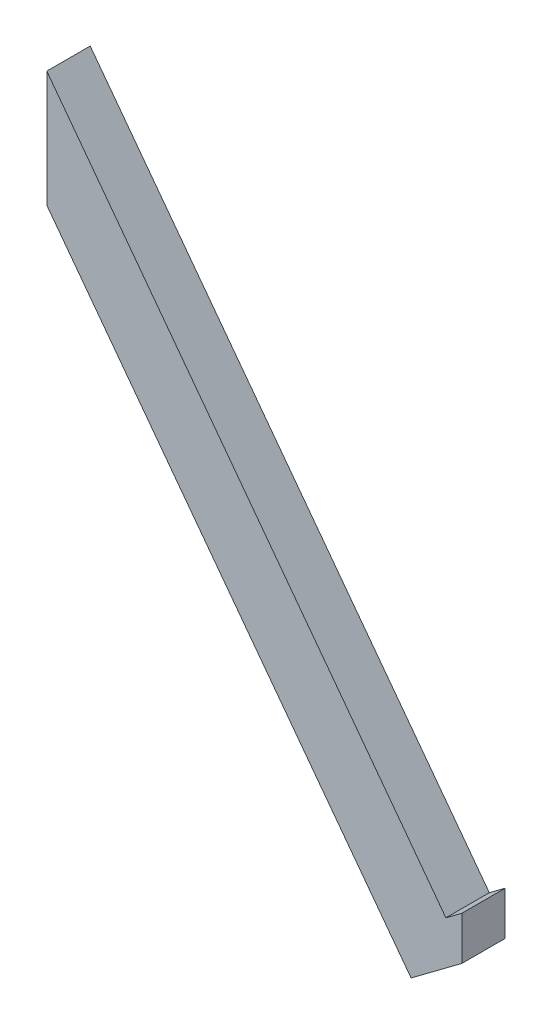
ISO-10303-21;
HEADER;
FILE_DESCRIPTION(('STEP AP214'),'2;1');
FILE_NAME('part.step','',(''),(''),'','','');
FILE_SCHEMA(('AUTOMOTIVE_DESIGN { 1 0 10303 214 1 1 1 1 }'));
ENDSEC;
DATA;
#1=APPLICATION_CONTEXT('core data for automotive mechanical design processes');
#2=APPLICATION_PROTOCOL_DEFINITION('international standard','automotive_design',2000,#1);
#3=PRODUCT_CONTEXT('',#1,'mechanical');
#4=PRODUCT('Part','Part','',(#3));
#5=PRODUCT_RELATED_PRODUCT_CATEGORY('part','',(#4));
#6=PRODUCT_DEFINITION_FORMATION('','',#4);
#7=PRODUCT_DEFINITION_CONTEXT('part definition',#1,'design');
#8=PRODUCT_DEFINITION('design','',#6,#7);
#9=PRODUCT_DEFINITION_SHAPE('','',#8);
#10=(LENGTH_UNIT() NAMED_UNIT(*) SI_UNIT(.MILLI.,.METRE.));
#11=(NAMED_UNIT(*) PLANE_ANGLE_UNIT() SI_UNIT($,.RADIAN.));
#12=(NAMED_UNIT(*) SI_UNIT($,.STERADIAN.) SOLID_ANGLE_UNIT());
#13=UNCERTAINTY_MEASURE_WITH_UNIT(LENGTH_MEASURE(1.E-05),#10,'distance_accuracy_value','');
#14=(GEOMETRIC_REPRESENTATION_CONTEXT(3) GLOBAL_UNCERTAINTY_ASSIGNED_CONTEXT((#13)) GLOBAL_UNIT_ASSIGNED_CONTEXT((#10,
#11,#12)) REPRESENTATION_CONTEXT('',''));
#15=CARTESIAN_POINT('',(0.,0.,0.));
#16=DIRECTION('',(0.,0.,1.));
#17=DIRECTION('',(1.,0.,0.));
#18=AXIS2_PLACEMENT_3D('',#15,#16,#17);
#19=CARTESIAN_POINT('',(-48.4510576676489,25.0386405763315,5.));
#20=DIRECTION('',(1.,0.,0.));
#21=DIRECTION('',(0.,0.,-1.));
#22=AXIS2_PLACEMENT_3D('',#19,#20,#21);
#23=PLANE('',#22);
#24=DIRECTION('',(0.,-1.,0.));
#25=VECTOR('',#24,1.);
#26=CARTESIAN_POINT('',(-48.4510576676489,25.0386405763315,0.));
#27=LINE('',#26,#25);
#28=CARTESIAN_POINT('',(-48.4510576676489,38.3967930670941,0.));
#29=VERTEX_POINT('',#28);
#30=CARTESIAN_POINT('',(-48.4510576676489,25.0386405763315,0.));
#31=VERTEX_POINT('',#30);
#32=EDGE_CURVE('E117',#29,#31,#27,.T.);
#33=ORIENTED_EDGE('',*,*,#32,.T.);
#34=DIRECTION('',(0.,0.,-1.));
#35=VECTOR('',#34,1.);
#36=CARTESIAN_POINT('',(-48.4510576676489,25.0386405763315,5.));
#37=LINE('',#36,#35);
#38=CARTESIAN_POINT('',(-48.4510576676489,25.0386405763315,5.));
#39=VERTEX_POINT('',#38);
#40=EDGE_CURVE('E11',#39,#31,#37,.T.);
#41=ORIENTED_EDGE('',*,*,#40,.F.);
#42=DIRECTION('',(0.,-1.,0.));
#43=VECTOR('',#42,1.);
#44=CARTESIAN_POINT('',(-48.4510576676489,25.0386405763315,5.));
#45=LINE('',#44,#43);
#46=CARTESIAN_POINT('',(-48.4510576676489,38.3967930670941,5.));
#47=VERTEX_POINT('',#46);
#48=EDGE_CURVE('E127',#47,#39,#45,.T.);
#49=ORIENTED_EDGE('',*,*,#48,.F.);
#50=DIRECTION('',(0.,0.,-1.));
#51=VECTOR('',#50,1.);
#52=CARTESIAN_POINT('',(-48.4510576676489,38.3967930670941,5.));
#53=LINE('',#52,#51);
#54=EDGE_CURVE('E113',#47,#29,#53,.T.);
#55=ORIENTED_EDGE('',*,*,#54,.T.);
#56=EDGE_LOOP('',(#33,#41,#49,#55));
#57=FACE_BOUND('',#56,.T.);
#58=ADVANCED_FACE('F33',(#57),#23,.F.);
#59=CARTESIAN_POINT('',(-6.52909275616516,-31.0198008750711,5.));
#60=DIRECTION('',(0.800834877877179,0.598885213021196,0.));
#61=DIRECTION('',(-0.598885213021196,0.80083487787718,0.));
#62=AXIS2_PLACEMENT_3D('',#59,#60,#61);
#63=PLANE('',#62);
#64=DIRECTION('',(0.598885213021196,-0.800834877877179,0.));
#65=VECTOR('',#64,1.);
#66=CARTESIAN_POINT('',(-6.52909275616516,-31.0198008750711,0.));
#67=LINE('',#66,#65);
#68=CARTESIAN_POINT('',(-6.52909275616516,-31.0198008750711,0.));
#69=VERTEX_POINT('',#68);
#70=EDGE_CURVE('E120',#31,#69,#67,.T.);
#71=ORIENTED_EDGE('',*,*,#70,.T.);
#72=DIRECTION('',(0.,0.,-1.));
#73=VECTOR('',#72,1.);
#74=CARTESIAN_POINT('',(-6.52909275616516,-31.0198008750711,5.));
#75=LINE('',#74,#73);
#76=CARTESIAN_POINT('',(-6.52909275616516,-31.0198008750711,5.));
#77=VERTEX_POINT('',#76);
#78=EDGE_CURVE('E41',#77,#69,#75,.T.);
#79=ORIENTED_EDGE('',*,*,#78,.F.);
#80=DIRECTION('',(0.598885213021196,-0.800834877877179,0.));
#81=VECTOR('',#80,1.);
#82=CARTESIAN_POINT('',(-6.52909275616516,-31.0198008750711,5.));
#83=LINE('',#82,#81);
#84=EDGE_CURVE('E86',#39,#77,#83,.T.);
#85=ORIENTED_EDGE('',*,*,#84,.F.);
#86=ORIENTED_EDGE('',*,*,#40,.T.);
#87=EDGE_LOOP('',(#71,#79,#85,#86));
#88=FACE_BOUND('',#87,.T.);
#89=ADVANCED_FACE('F151',(#88),#63,.F.);
#90=CARTESIAN_POINT('',(-0.693903445079616,-26.6560940859115,5.));
#91=DIRECTION('',(-0.598885213021196,0.80083487787718,0.));
#92=DIRECTION('',(-0.80083487787718,-0.598885213021196,0.));
#93=AXIS2_PLACEMENT_3D('',#90,#91,#92);
#94=PLANE('',#93);
#95=DIRECTION('',(0.80083487787718,0.598885213021196,0.));
#96=VECTOR('',#95,1.);
#97=CARTESIAN_POINT('',(-0.693903445079616,-26.6560940859115,0.));
#98=LINE('',#97,#96);
#99=CARTESIAN_POINT('',(-0.693903445079616,-26.6560940859115,0.));
#100=VERTEX_POINT('',#99);
#101=EDGE_CURVE('E122',#69,#100,#98,.T.);
#102=ORIENTED_EDGE('',*,*,#101,.T.);
#103=DIRECTION('',(0.,0.,-1.));
#104=VECTOR('',#103,1.);
#105=CARTESIAN_POINT('',(-0.693903445079616,-26.6560940859115,5.));
#106=LINE('',#105,#104);
#107=CARTESIAN_POINT('',(-0.693903445079616,-26.6560940859115,5.));
#108=VERTEX_POINT('',#107);
#109=EDGE_CURVE('E108',#108,#100,#106,.T.);
#110=ORIENTED_EDGE('',*,*,#109,.F.);
#111=DIRECTION('',(0.80083487787718,0.598885213021196,0.));
#112=VECTOR('',#111,1.);
#113=CARTESIAN_POINT('',(-0.693903445079616,-26.6560940859115,5.));
#114=LINE('',#113,#112);
#115=EDGE_CURVE('E99',#77,#108,#114,.T.);
#116=ORIENTED_EDGE('',*,*,#115,.F.);
#117=ORIENTED_EDGE('',*,*,#78,.T.);
#118=EDGE_LOOP('',(#102,#110,#116,#117));
#119=FACE_BOUND('',#118,.T.);
#120=ADVANCED_FACE('F133',(#119),#94,.F.);
#121=CARTESIAN_POINT('',(-0.693903445079618,-21.6496036691413,5.));
#122=DIRECTION('',(-1.,0.,0.));
#123=DIRECTION('',(0.,-1.,0.));
#124=AXIS2_PLACEMENT_3D('',#121,#122,#123);
#125=PLANE('',#124);
#126=DIRECTION('',(0.,1.,0.));
#127=VECTOR('',#126,1.);
#128=CARTESIAN_POINT('',(-0.693903445079618,-21.6496036691413,0.));
#129=LINE('',#128,#127);
#130=CARTESIAN_POINT('',(-0.693903445079618,-21.6496036691413,0.));
#131=VERTEX_POINT('',#130);
#132=EDGE_CURVE('E107',#100,#131,#129,.T.);
#133=ORIENTED_EDGE('',*,*,#132,.T.);
#134=DIRECTION('',(0.,0.,-1.));
#135=VECTOR('',#134,1.);
#136=CARTESIAN_POINT('',(-0.693903445079618,-21.6496036691413,5.));
#137=LINE('',#136,#135);
#138=CARTESIAN_POINT('',(-0.693903445079618,-21.6496036691413,5.));
#139=VERTEX_POINT('',#138);
#140=EDGE_CURVE('E104',#139,#131,#137,.T.);
#141=ORIENTED_EDGE('',*,*,#140,.F.);
#142=DIRECTION('',(0.,1.,0.));
#143=VECTOR('',#142,1.);
#144=CARTESIAN_POINT('',(-0.693903445079618,-21.6496036691413,5.));
#145=LINE('',#144,#143);
#146=EDGE_CURVE('E93',#108,#139,#145,.T.);
#147=ORIENTED_EDGE('',*,*,#146,.F.);
#148=ORIENTED_EDGE('',*,*,#109,.T.);
#149=EDGE_LOOP('',(#133,#141,#147,#148));
#150=FACE_BOUND('',#149,.T.);
#151=ADVANCED_FACE('F105',(#150),#125,.F.);
#152=CARTESIAN_POINT('',(-2.5235674221956,-23.0178741215933,5.));
#153=DIRECTION('',(0.598885213021197,-0.800834877877179,0.));
#154=DIRECTION('',(0.800834877877179,0.598885213021197,0.));
#155=AXIS2_PLACEMENT_3D('',#152,#153,#154);
#156=PLANE('',#155);
#157=DIRECTION('',(-0.800834877877179,-0.598885213021197,0.));
#158=VECTOR('',#157,1.);
#159=CARTESIAN_POINT('',(-2.5235674221956,-23.0178741215933,0.));
#160=LINE('',#159,#158);
#161=CARTESIAN_POINT('',(-2.5235674221956,-23.0178741215933,0.));
#162=VERTEX_POINT('',#161);
#163=EDGE_CURVE('E72',#131,#162,#160,.T.);
#164=ORIENTED_EDGE('',*,*,#163,.T.);
#165=DIRECTION('',(0.,0.,-1.));
#166=VECTOR('',#165,1.);
#167=CARTESIAN_POINT('',(-2.5235674221956,-23.0178741215933,5.));
#168=LINE('',#167,#166);
#169=CARTESIAN_POINT('',(-2.5235674221956,-23.0178741215933,5.));
#170=VERTEX_POINT('',#169);
#171=EDGE_CURVE('E109',#170,#162,#168,.T.);
#172=ORIENTED_EDGE('',*,*,#171,.F.);
#173=DIRECTION('',(-0.800834877877179,-0.598885213021197,0.));
#174=VECTOR('',#173,1.);
#175=CARTESIAN_POINT('',(-2.5235674221956,-23.0178741215933,5.));
#176=LINE('',#175,#174);
#177=EDGE_CURVE('E97',#139,#170,#176,.T.);
#178=ORIENTED_EDGE('',*,*,#177,.F.);
#179=ORIENTED_EDGE('',*,*,#140,.T.);
#180=EDGE_LOOP('',(#164,#172,#178,#179));
#181=FACE_BOUND('',#180,.T.);
#182=ADVANCED_FACE('F111',(#181),#156,.F.);
#183=CARTESIAN_POINT('',(-48.4510576676489,38.3967930670941,5.));
#184=DIRECTION('',(-0.800834877877179,-0.598885213021196,0.));
#185=DIRECTION('',(0.598885213021196,-0.800834877877179,0.));
#186=AXIS2_PLACEMENT_3D('',#183,#184,#185);
#187=PLANE('',#186);
#188=DIRECTION('',(-0.598885213021196,0.800834877877179,0.));
#189=VECTOR('',#188,1.);
#190=CARTESIAN_POINT('',(-48.4510576676489,38.3967930670941,0.));
#191=LINE('',#190,#189);
#192=EDGE_CURVE('E78',#162,#29,#191,.T.);
#193=ORIENTED_EDGE('',*,*,#192,.T.);
#194=ORIENTED_EDGE('',*,*,#54,.F.);
#195=DIRECTION('',(-0.598885213021196,0.800834877877179,0.));
#196=VECTOR('',#195,1.);
#197=CARTESIAN_POINT('',(-48.4510576676489,38.3967930670941,5.));
#198=LINE('',#197,#196);
#199=EDGE_CURVE('E49',#170,#47,#198,.T.);
#200=ORIENTED_EDGE('',*,*,#199,.F.);
#201=ORIENTED_EDGE('',*,*,#171,.T.);
#202=EDGE_LOOP('',(#193,#194,#200,#201));
#203=FACE_BOUND('',#202,.T.);
#204=ADVANCED_FACE('F140',(#203),#187,.F.);
#205=CARTESIAN_POINT('',(0.,0.,5.));
#206=DIRECTION('',(0.,0.,-1.));
#207=DIRECTION('',(-1.,0.,0.));
#208=AXIS2_PLACEMENT_3D('',#205,#206,#207);
#209=PLANE('',#208);
#210=ORIENTED_EDGE('',*,*,#48,.T.);
#211=ORIENTED_EDGE('',*,*,#84,.T.);
#212=ORIENTED_EDGE('',*,*,#115,.T.);
#213=ORIENTED_EDGE('',*,*,#146,.T.);
#214=ORIENTED_EDGE('',*,*,#177,.T.);
#215=ORIENTED_EDGE('',*,*,#199,.T.);
#216=EDGE_LOOP('',(#210,#211,#212,#213,#214,#215));
#217=FACE_BOUND('',#216,.T.);
#218=ADVANCED_FACE('F95',(#217),#209,.F.);
#219=CARTESIAN_POINT('',(0.,0.,0.));
#220=DIRECTION('',(0.,0.,-1.));
#221=DIRECTION('',(-1.,0.,0.));
#222=AXIS2_PLACEMENT_3D('',#219,#220,#221);
#223=PLANE('',#222);
#224=ORIENTED_EDGE('',*,*,#32,.F.);
#225=ORIENTED_EDGE('',*,*,#192,.F.);
#226=ORIENTED_EDGE('',*,*,#163,.F.);
#227=ORIENTED_EDGE('',*,*,#132,.F.);
#228=ORIENTED_EDGE('',*,*,#101,.F.);
#229=ORIENTED_EDGE('',*,*,#70,.F.);
#230=EDGE_LOOP('',(#224,#225,#226,#227,#228,#229));
#231=FACE_BOUND('',#230,.T.);
#232=ADVANCED_FACE('F136',(#231),#223,.T.);
#233=CLOSED_SHELL('',(#58,#89,#120,#151,#182,#204,#218,#232));
#234=MANIFOLD_SOLID_BREP('B2',#233);
#235=ADVANCED_BREP_SHAPE_REPRESENTATION('',(#18,#234),#14);
#236=SHAPE_DEFINITION_REPRESENTATION(#9,#235);
ENDSEC;
END-ISO-10303-21;
